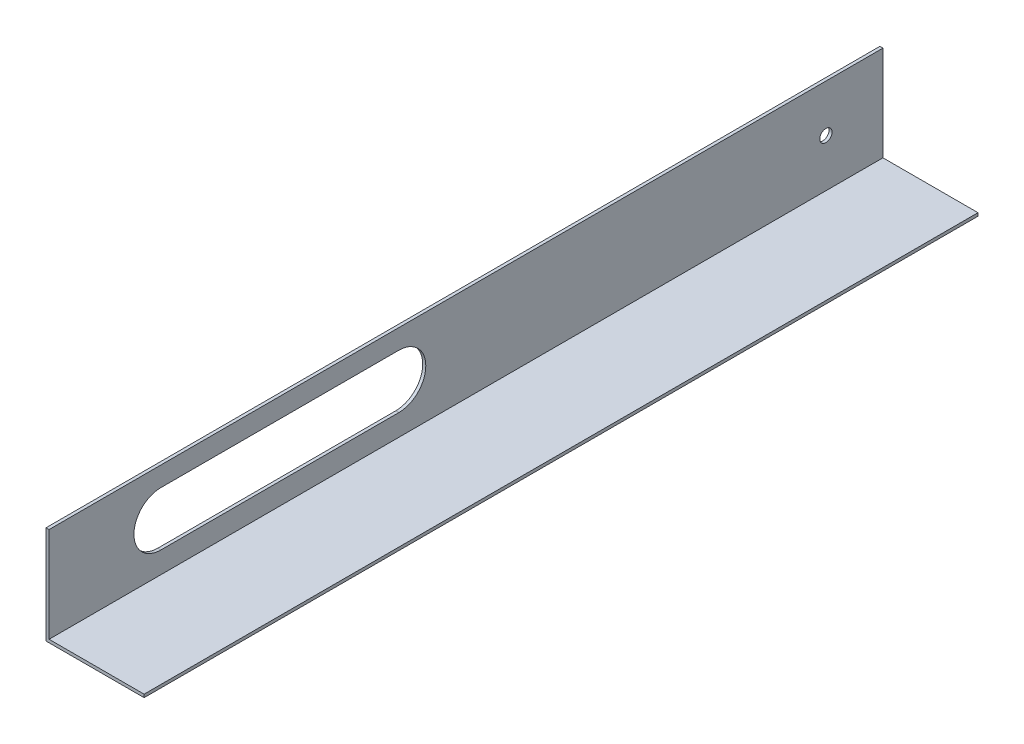
ISO-10303-21;
HEADER;
FILE_DESCRIPTION(('STEP AP214'),'2;1');
FILE_NAME('part.step','',(''),(''),'','','');
FILE_SCHEMA(('AUTOMOTIVE_DESIGN { 1 0 10303 214 1 1 1 1 }'));
ENDSEC;
DATA;
#1=APPLICATION_CONTEXT('core data for automotive mechanical design processes');
#2=APPLICATION_PROTOCOL_DEFINITION('international standard','automotive_design',2000,#1);
#3=PRODUCT_CONTEXT('',#1,'mechanical');
#4=PRODUCT('Part','Part','',(#3));
#5=PRODUCT_RELATED_PRODUCT_CATEGORY('part','',(#4));
#6=PRODUCT_DEFINITION_FORMATION('','',#4);
#7=PRODUCT_DEFINITION_CONTEXT('part definition',#1,'design');
#8=PRODUCT_DEFINITION('design','',#6,#7);
#9=PRODUCT_DEFINITION_SHAPE('','',#8);
#10=(LENGTH_UNIT() NAMED_UNIT(*) SI_UNIT(.MILLI.,.METRE.));
#11=(NAMED_UNIT(*) PLANE_ANGLE_UNIT() SI_UNIT($,.RADIAN.));
#12=(NAMED_UNIT(*) SI_UNIT($,.STERADIAN.) SOLID_ANGLE_UNIT());
#13=UNCERTAINTY_MEASURE_WITH_UNIT(LENGTH_MEASURE(1.E-05),#10,'distance_accuracy_value','');
#14=(GEOMETRIC_REPRESENTATION_CONTEXT(3) GLOBAL_UNCERTAINTY_ASSIGNED_CONTEXT((#13)) GLOBAL_UNIT_ASSIGNED_CONTEXT((#10,
#11,#12)) REPRESENTATION_CONTEXT('',''));
#15=CARTESIAN_POINT('',(0.,0.,0.));
#16=DIRECTION('',(0.,0.,1.));
#17=DIRECTION('',(1.,0.,0.));
#18=AXIS2_PLACEMENT_3D('',#15,#16,#17);
#19=CARTESIAN_POINT('',(49.2125,0.,431.8));
#20=DIRECTION('',(0.,-1.,0.));
#21=DIRECTION('',(1.,0.,0.));
#22=AXIS2_PLACEMENT_3D('',#19,#20,#21);
#23=PLANE('',#22);
#24=DIRECTION('',(-1.,0.,0.));
#25=VECTOR('',#24,1.);
#26=CARTESIAN_POINT('',(49.2125,0.,0.));
#27=LINE('',#26,#25);
#28=CARTESIAN_POINT('',(49.2125,0.,0.));
#29=VERTEX_POINT('',#28);
#30=CARTESIAN_POINT('',(0.,0.,0.));
#31=VERTEX_POINT('',#30);
#32=EDGE_CURVE('E136',#29,#31,#27,.T.);
#33=ORIENTED_EDGE('',*,*,#32,.T.);
#34=DIRECTION('',(0.,0.,-1.));
#35=VECTOR('',#34,1.);
#36=CARTESIAN_POINT('',(0.,0.,431.8));
#37=LINE('',#36,#35);
#38=CARTESIAN_POINT('',(0.,0.,431.8));
#39=VERTEX_POINT('',#38);
#40=EDGE_CURVE('E179',#39,#31,#37,.T.);
#41=ORIENTED_EDGE('',*,*,#40,.F.);
#42=DIRECTION('',(-1.,0.,0.));
#43=VECTOR('',#42,1.);
#44=CARTESIAN_POINT('',(49.2125,0.,431.8));
#45=LINE('',#44,#43);
#46=CARTESIAN_POINT('',(49.2125,0.,431.8));
#47=VERTEX_POINT('',#46);
#48=EDGE_CURVE('E139',#47,#39,#45,.T.);
#49=ORIENTED_EDGE('',*,*,#48,.F.);
#50=DIRECTION('',(0.,0.,-1.));
#51=VECTOR('',#50,1.);
#52=CARTESIAN_POINT('',(49.2125,0.,431.8));
#53=LINE('',#52,#51);
#54=EDGE_CURVE('E153',#47,#29,#53,.T.);
#55=ORIENTED_EDGE('',*,*,#54,.T.);
#56=EDGE_LOOP('',(#33,#41,#49,#55));
#57=FACE_BOUND('',#56,.T.);
#58=ADVANCED_FACE('F33',(#57),#23,.F.);
#59=CARTESIAN_POINT('',(0.,0.,431.8));
#60=DIRECTION('',(-1.,0.,0.));
#61=DIRECTION('',(0.,-1.,0.));
#62=AXIS2_PLACEMENT_3D('',#59,#60,#61);
#63=PLANE('',#62);
#64=CARTESIAN_POINT('',(0.,24.7735948291677,29.5387922851518));
#65=DIRECTION('',(1.,0.,0.));
#66=DIRECTION('',(0.,1.,0.));
#67=AXIS2_PLACEMENT_3D('',#64,#65,#66);
#68=CIRCLE('',#67,3.175);
#69=CARTESIAN_POINT('',(0.,27.9485948291677,29.5387922851518));
#70=VERTEX_POINT('',#69);
#71=EDGE_CURVE('E312',#70,#70,#68,.T.);
#72=ORIENTED_EDGE('',*,*,#71,.F.);
#73=EDGE_LOOP('',(#72));
#74=FACE_BOUND('',#73,.T.);
#75=DIRECTION('',(0.,0.,-1.));
#76=VECTOR('',#75,1.);
#77=CARTESIAN_POINT('',(0.,11.1125,373.888));
#78=LINE('',#77,#76);
#79=CARTESIAN_POINT('',(0.,11.1125,373.888));
#80=VERTEX_POINT('',#79);
#81=CARTESIAN_POINT('',(0.,11.1125,250.698));
#82=VERTEX_POINT('',#81);
#83=EDGE_CURVE('E122',#80,#82,#78,.T.);
#84=ORIENTED_EDGE('',*,*,#83,.F.);
#85=CARTESIAN_POINT('',(0.,25.0825,373.888));
#86=DIRECTION('',(1.,0.,0.));
#87=DIRECTION('',(0.,1.,0.));
#88=AXIS2_PLACEMENT_3D('',#85,#86,#87);
#89=CIRCLE('',#88,13.97);
#90=CARTESIAN_POINT('',(0.,39.0525,373.888));
#91=VERTEX_POINT('',#90);
#92=EDGE_CURVE('E48',#91,#80,#89,.T.);
#93=ORIENTED_EDGE('',*,*,#92,.F.);
#94=DIRECTION('',(0.,0.,1.));
#95=VECTOR('',#94,1.);
#96=CARTESIAN_POINT('',(0.,39.0525,373.888));
#97=LINE('',#96,#95);
#98=CARTESIAN_POINT('',(0.,39.0525,250.698));
#99=VERTEX_POINT('',#98);
#100=EDGE_CURVE('E129',#99,#91,#97,.T.);
#101=ORIENTED_EDGE('',*,*,#100,.F.);
#102=CARTESIAN_POINT('',(0.,25.0825,250.698));
#103=DIRECTION('',(1.,0.,0.));
#104=DIRECTION('',(0.,1.,0.));
#105=AXIS2_PLACEMENT_3D('',#102,#103,#104);
#106=CIRCLE('',#105,13.97);
#107=EDGE_CURVE('E113',#82,#99,#106,.T.);
#108=ORIENTED_EDGE('',*,*,#107,.F.);
#109=EDGE_LOOP('',(#84,#93,#101,#108));
#110=FACE_BOUND('',#109,.T.);
#111=DIRECTION('',(0.,1.,0.));
#112=VECTOR('',#111,1.);
#113=CARTESIAN_POINT('',(0.,0.,0.));
#114=LINE('',#113,#112);
#115=CARTESIAN_POINT('',(0.,49.2125,0.));
#116=VERTEX_POINT('',#115);
#117=EDGE_CURVE('E156',#31,#116,#114,.T.);
#118=ORIENTED_EDGE('',*,*,#117,.T.);
#119=DIRECTION('',(0.,0.,-1.));
#120=VECTOR('',#119,1.);
#121=CARTESIAN_POINT('',(0.,49.2125,431.8));
#122=LINE('',#121,#120);
#123=CARTESIAN_POINT('',(0.,49.2125,431.8));
#124=VERTEX_POINT('',#123);
#125=EDGE_CURVE('E176',#124,#116,#122,.T.);
#126=ORIENTED_EDGE('',*,*,#125,.F.);
#127=DIRECTION('',(0.,1.,0.));
#128=VECTOR('',#127,1.);
#129=CARTESIAN_POINT('',(0.,0.,431.8));
#130=LINE('',#129,#128);
#131=EDGE_CURVE('E142',#39,#124,#130,.T.);
#132=ORIENTED_EDGE('',*,*,#131,.F.);
#133=ORIENTED_EDGE('',*,*,#40,.T.);
#134=EDGE_LOOP('',(#118,#126,#132,#133));
#135=FACE_BOUND('',#134,.T.);
#136=ADVANCED_FACE('F126',(#74,#110,#135),#63,.F.);
#137=CARTESIAN_POINT('',(0.,49.2125,431.8));
#138=DIRECTION('',(0.,-1.,0.));
#139=DIRECTION('',(1.,0.,0.));
#140=AXIS2_PLACEMENT_3D('',#137,#138,#139);
#141=PLANE('',#140);
#142=DIRECTION('',(-1.,0.,0.));
#143=VECTOR('',#142,1.);
#144=CARTESIAN_POINT('',(0.,49.2125,0.));
#145=LINE('',#144,#143);
#146=CARTESIAN_POINT('',(-1.5875,49.2125,0.));
#147=VERTEX_POINT('',#146);
#148=EDGE_CURVE('E158',#116,#147,#145,.T.);
#149=ORIENTED_EDGE('',*,*,#148,.T.);
#150=DIRECTION('',(0.,0.,-1.));
#151=VECTOR('',#150,1.);
#152=CARTESIAN_POINT('',(-1.5875,49.2125,431.8));
#153=LINE('',#152,#151);
#154=CARTESIAN_POINT('',(-1.5875,49.2125,431.8));
#155=VERTEX_POINT('',#154);
#156=EDGE_CURVE('E173',#155,#147,#153,.T.);
#157=ORIENTED_EDGE('',*,*,#156,.F.);
#158=DIRECTION('',(-1.,0.,0.));
#159=VECTOR('',#158,1.);
#160=CARTESIAN_POINT('',(0.,49.2125,431.8));
#161=LINE('',#160,#159);
#162=EDGE_CURVE('E145',#124,#155,#161,.T.);
#163=ORIENTED_EDGE('',*,*,#162,.F.);
#164=ORIENTED_EDGE('',*,*,#125,.T.);
#165=EDGE_LOOP('',(#149,#157,#163,#164));
#166=FACE_BOUND('',#165,.T.);
#167=ADVANCED_FACE('F211',(#166),#141,.F.);
#168=CARTESIAN_POINT('',(-1.5875,49.2125,431.8));
#169=DIRECTION('',(1.,0.,0.));
#170=DIRECTION('',(0.,1.,0.));
#171=AXIS2_PLACEMENT_3D('',#168,#169,#170);
#172=PLANE('',#171);
#173=CARTESIAN_POINT('',(-1.58749999999999,24.7735948291677,29.5387922851518));
#174=DIRECTION('',(1.,0.,0.));
#175=DIRECTION('',(0.,1.,0.));
#176=AXIS2_PLACEMENT_3D('',#173,#174,#175);
#177=CIRCLE('',#176,3.175);
#178=CARTESIAN_POINT('',(-1.58749999999999,27.9485948291677,29.5387922851518));
#179=VERTEX_POINT('',#178);
#180=EDGE_CURVE('E36',#179,#179,#177,.T.);
#181=ORIENTED_EDGE('',*,*,#180,.T.);
#182=EDGE_LOOP('',(#181));
#183=FACE_BOUND('',#182,.T.);
#184=DIRECTION('',(0.,0.,1.));
#185=VECTOR('',#184,1.);
#186=CARTESIAN_POINT('',(-1.5875,39.0525,431.8));
#187=LINE('',#186,#185);
#188=CARTESIAN_POINT('',(-1.58749999999999,39.0525,250.698));
#189=VERTEX_POINT('',#188);
#190=CARTESIAN_POINT('',(-1.58749999999999,39.0525,373.888));
#191=VERTEX_POINT('',#190);
#192=EDGE_CURVE('E41',#189,#191,#187,.T.);
#193=ORIENTED_EDGE('',*,*,#192,.T.);
#194=CARTESIAN_POINT('',(-1.58749999999999,25.0825,373.888));
#195=DIRECTION('',(1.,0.,0.));
#196=DIRECTION('',(0.,1.,0.));
#197=AXIS2_PLACEMENT_3D('',#194,#195,#196);
#198=CIRCLE('',#197,13.97);
#199=CARTESIAN_POINT('',(-1.58749999999999,11.1125,373.888));
#200=VERTEX_POINT('',#199);
#201=EDGE_CURVE('E11',#191,#200,#198,.T.);
#202=ORIENTED_EDGE('',*,*,#201,.T.);
#203=DIRECTION('',(0.,0.,-1.));
#204=VECTOR('',#203,1.);
#205=CARTESIAN_POINT('',(-1.5875,11.1125,431.8));
#206=LINE('',#205,#204);
#207=CARTESIAN_POINT('',(-1.5875,11.1125,250.698));
#208=VERTEX_POINT('',#207);
#209=EDGE_CURVE('E182',#200,#208,#206,.T.);
#210=ORIENTED_EDGE('',*,*,#209,.T.);
#211=CARTESIAN_POINT('',(-1.58749999999999,25.0825,250.698));
#212=DIRECTION('',(1.,0.,0.));
#213=DIRECTION('',(0.,1.,0.));
#214=AXIS2_PLACEMENT_3D('',#211,#212,#213);
#215=CIRCLE('',#214,13.97);
#216=EDGE_CURVE('E116',#208,#189,#215,.T.);
#217=ORIENTED_EDGE('',*,*,#216,.T.);
#218=EDGE_LOOP('',(#193,#202,#210,#217));
#219=FACE_BOUND('',#218,.T.);
#220=DIRECTION('',(0.,-1.,0.));
#221=VECTOR('',#220,1.);
#222=CARTESIAN_POINT('',(-1.5875,49.2125,0.));
#223=LINE('',#222,#221);
#224=CARTESIAN_POINT('',(-1.58750000000001,-1.5875,0.));
#225=VERTEX_POINT('',#224);
#226=EDGE_CURVE('E160',#147,#225,#223,.T.);
#227=ORIENTED_EDGE('',*,*,#226,.T.);
#228=DIRECTION('',(0.,0.,-1.));
#229=VECTOR('',#228,1.);
#230=CARTESIAN_POINT('',(-1.58750000000001,-1.5875,431.8));
#231=LINE('',#230,#229);
#232=CARTESIAN_POINT('',(-1.58750000000001,-1.5875,431.8));
#233=VERTEX_POINT('',#232);
#234=EDGE_CURVE('E170',#233,#225,#231,.T.);
#235=ORIENTED_EDGE('',*,*,#234,.F.);
#236=DIRECTION('',(0.,-1.,0.));
#237=VECTOR('',#236,1.);
#238=CARTESIAN_POINT('',(-1.5875,49.2125,431.8));
#239=LINE('',#238,#237);
#240=EDGE_CURVE('E147',#155,#233,#239,.T.);
#241=ORIENTED_EDGE('',*,*,#240,.F.);
#242=ORIENTED_EDGE('',*,*,#156,.T.);
#243=EDGE_LOOP('',(#227,#235,#241,#242));
#244=FACE_BOUND('',#243,.T.);
#245=ADVANCED_FACE('F187',(#183,#219,#244),#172,.F.);
#246=CARTESIAN_POINT('',(-1.58750000000001,-1.5875,431.8));
#247=DIRECTION('',(0.,1.,0.));
#248=DIRECTION('',(-1.,0.,0.));
#249=AXIS2_PLACEMENT_3D('',#246,#247,#248);
#250=PLANE('',#249);
#251=DIRECTION('',(1.,0.,0.));
#252=VECTOR('',#251,1.);
#253=CARTESIAN_POINT('',(-1.58750000000001,-1.5875,0.));
#254=LINE('',#253,#252);
#255=CARTESIAN_POINT('',(49.2125,-1.58749999999999,0.));
#256=VERTEX_POINT('',#255);
#257=EDGE_CURVE('E162',#225,#256,#254,.T.);
#258=ORIENTED_EDGE('',*,*,#257,.T.);
#259=DIRECTION('',(0.,0.,-1.));
#260=VECTOR('',#259,1.);
#261=CARTESIAN_POINT('',(49.2125,-1.58749999999999,431.8));
#262=LINE('',#261,#260);
#263=CARTESIAN_POINT('',(49.2125,-1.58749999999999,431.8));
#264=VERTEX_POINT('',#263);
#265=EDGE_CURVE('E167',#264,#256,#262,.T.);
#266=ORIENTED_EDGE('',*,*,#265,.F.);
#267=DIRECTION('',(1.,0.,0.));
#268=VECTOR('',#267,1.);
#269=CARTESIAN_POINT('',(-1.58750000000001,-1.5875,431.8));
#270=LINE('',#269,#268);
#271=EDGE_CURVE('E149',#233,#264,#270,.T.);
#272=ORIENTED_EDGE('',*,*,#271,.F.);
#273=ORIENTED_EDGE('',*,*,#234,.T.);
#274=EDGE_LOOP('',(#258,#266,#272,#273));
#275=FACE_BOUND('',#274,.T.);
#276=ADVANCED_FACE('F230',(#275),#250,.F.);
#277=CARTESIAN_POINT('',(49.2125,-1.58749999999999,431.8));
#278=DIRECTION('',(-1.,0.,0.));
#279=DIRECTION('',(0.,-1.,0.));
#280=AXIS2_PLACEMENT_3D('',#277,#278,#279);
#281=PLANE('',#280);
#282=DIRECTION('',(0.,1.,0.));
#283=VECTOR('',#282,1.);
#284=CARTESIAN_POINT('',(49.2125,-1.58749999999999,0.));
#285=LINE('',#284,#283);
#286=EDGE_CURVE('E143',#256,#29,#285,.T.);
#287=ORIENTED_EDGE('',*,*,#286,.T.);
#288=ORIENTED_EDGE('',*,*,#54,.F.);
#289=DIRECTION('',(0.,1.,0.));
#290=VECTOR('',#289,1.);
#291=CARTESIAN_POINT('',(49.2125,-1.58749999999999,431.8));
#292=LINE('',#291,#290);
#293=EDGE_CURVE('E151',#264,#47,#292,.T.);
#294=ORIENTED_EDGE('',*,*,#293,.F.);
#295=ORIENTED_EDGE('',*,*,#265,.T.);
#296=EDGE_LOOP('',(#287,#288,#294,#295));
#297=FACE_BOUND('',#296,.T.);
#298=ADVANCED_FACE('F228',(#297),#281,.F.);
#299=CARTESIAN_POINT('',(0.,0.,431.8));
#300=DIRECTION('',(0.,0.,-1.));
#301=DIRECTION('',(-1.,0.,0.));
#302=AXIS2_PLACEMENT_3D('',#299,#300,#301);
#303=PLANE('',#302);
#304=ORIENTED_EDGE('',*,*,#48,.T.);
#305=ORIENTED_EDGE('',*,*,#131,.T.);
#306=ORIENTED_EDGE('',*,*,#162,.T.);
#307=ORIENTED_EDGE('',*,*,#240,.T.);
#308=ORIENTED_EDGE('',*,*,#271,.T.);
#309=ORIENTED_EDGE('',*,*,#293,.T.);
#310=EDGE_LOOP('',(#304,#305,#306,#307,#308,#309));
#311=FACE_BOUND('',#310,.T.);
#312=ADVANCED_FACE('F201',(#311),#303,.F.);
#313=CARTESIAN_POINT('',(0.,0.,0.));
#314=DIRECTION('',(0.,0.,-1.));
#315=DIRECTION('',(-1.,0.,0.));
#316=AXIS2_PLACEMENT_3D('',#313,#314,#315);
#317=PLANE('',#316);
#318=ORIENTED_EDGE('',*,*,#32,.F.);
#319=ORIENTED_EDGE('',*,*,#286,.F.);
#320=ORIENTED_EDGE('',*,*,#257,.F.);
#321=ORIENTED_EDGE('',*,*,#226,.F.);
#322=ORIENTED_EDGE('',*,*,#148,.F.);
#323=ORIENTED_EDGE('',*,*,#117,.F.);
#324=EDGE_LOOP('',(#318,#319,#320,#321,#322,#323));
#325=FACE_BOUND('',#324,.T.);
#326=ADVANCED_FACE('F194',(#325),#317,.T.);
#327=CARTESIAN_POINT('',(-127.,25.0825,373.888));
#328=DIRECTION('',(1.,0.,0.));
#329=DIRECTION('',(0.,1.,0.));
#330=AXIS2_PLACEMENT_3D('',#327,#328,#329);
#331=CYLINDRICAL_SURFACE('',#330,13.97);
#332=DIRECTION('',(1.,0.,0.));
#333=VECTOR('',#332,1.);
#334=CARTESIAN_POINT('',(-127.,39.0525,373.888));
#335=LINE('',#334,#333);
#336=EDGE_CURVE('E134',#191,#91,#335,.T.);
#337=ORIENTED_EDGE('',*,*,#336,.T.);
#338=ORIENTED_EDGE('',*,*,#92,.T.);
#339=DIRECTION('',(1.,0.,0.));
#340=VECTOR('',#339,1.);
#341=CARTESIAN_POINT('',(-127.,11.1125,373.888));
#342=LINE('',#341,#340);
#343=EDGE_CURVE('E119',#200,#80,#342,.T.);
#344=ORIENTED_EDGE('',*,*,#343,.F.);
#345=ORIENTED_EDGE('',*,*,#201,.F.);
#346=EDGE_LOOP('',(#337,#338,#344,#345));
#347=FACE_BOUND('',#346,.T.);
#348=ADVANCED_FACE('F192',(#347),#331,.F.);
#349=CARTESIAN_POINT('',(-127.,39.0525,373.888));
#350=DIRECTION('',(0.,1.,0.));
#351=DIRECTION('',(-1.,0.,0.));
#352=AXIS2_PLACEMENT_3D('',#349,#350,#351);
#353=PLANE('',#352);
#354=DIRECTION('',(1.,0.,0.));
#355=VECTOR('',#354,1.);
#356=CARTESIAN_POINT('',(-127.,39.0525,250.698));
#357=LINE('',#356,#355);
#358=EDGE_CURVE('E118',#189,#99,#357,.T.);
#359=ORIENTED_EDGE('',*,*,#358,.T.);
#360=ORIENTED_EDGE('',*,*,#100,.T.);
#361=ORIENTED_EDGE('',*,*,#336,.F.);
#362=ORIENTED_EDGE('',*,*,#192,.F.);
#363=EDGE_LOOP('',(#359,#360,#361,#362));
#364=FACE_BOUND('',#363,.T.);
#365=ADVANCED_FACE('F191',(#364),#353,.F.);
#366=CARTESIAN_POINT('',(-127.,25.0825,250.698));
#367=DIRECTION('',(1.,0.,0.));
#368=DIRECTION('',(0.,1.,0.));
#369=AXIS2_PLACEMENT_3D('',#366,#367,#368);
#370=CYLINDRICAL_SURFACE('',#369,13.97);
#371=DIRECTION('',(1.,0.,0.));
#372=VECTOR('',#371,1.);
#373=CARTESIAN_POINT('',(-127.,11.1125,250.698));
#374=LINE('',#373,#372);
#375=EDGE_CURVE('E56',#208,#82,#374,.T.);
#376=ORIENTED_EDGE('',*,*,#375,.T.);
#377=ORIENTED_EDGE('',*,*,#107,.T.);
#378=ORIENTED_EDGE('',*,*,#358,.F.);
#379=ORIENTED_EDGE('',*,*,#216,.F.);
#380=EDGE_LOOP('',(#376,#377,#378,#379));
#381=FACE_BOUND('',#380,.T.);
#382=ADVANCED_FACE('F110',(#381),#370,.F.);
#383=CARTESIAN_POINT('',(-127.,11.1125,373.888));
#384=DIRECTION('',(0.,-1.,0.));
#385=DIRECTION('',(1.,0.,0.));
#386=AXIS2_PLACEMENT_3D('',#383,#384,#385);
#387=PLANE('',#386);
#388=ORIENTED_EDGE('',*,*,#343,.T.);
#389=ORIENTED_EDGE('',*,*,#83,.T.);
#390=ORIENTED_EDGE('',*,*,#375,.F.);
#391=ORIENTED_EDGE('',*,*,#209,.F.);
#392=EDGE_LOOP('',(#388,#389,#390,#391));
#393=FACE_BOUND('',#392,.T.);
#394=ADVANCED_FACE('F123',(#393),#387,.F.);
#395=CARTESIAN_POINT('',(-127.,24.7735948291677,29.5387922851518));
#396=DIRECTION('',(1.,0.,0.));
#397=DIRECTION('',(0.,1.,0.));
#398=AXIS2_PLACEMENT_3D('',#395,#396,#397);
#399=CYLINDRICAL_SURFACE('',#398,3.175);
#400=ORIENTED_EDGE('',*,*,#71,.T.);
#401=EDGE_LOOP('',(#400));
#402=FACE_BOUND('',#401,.T.);
#403=ORIENTED_EDGE('',*,*,#180,.F.);
#404=EDGE_LOOP('',(#403));
#405=FACE_BOUND('',#404,.T.);
#406=ADVANCED_FACE('F282',(#402,#405),#399,.F.);
#407=CLOSED_SHELL('',(#58,#136,#167,#245,#276,#298,#312,#326,#348,#365,#382,#394,#406));
#408=MANIFOLD_SOLID_BREP('B2',#407);
#409=ADVANCED_BREP_SHAPE_REPRESENTATION('',(#18,#408),#14);
#410=SHAPE_DEFINITION_REPRESENTATION(#9,#409);
ENDSEC;
END-ISO-10303-21;
